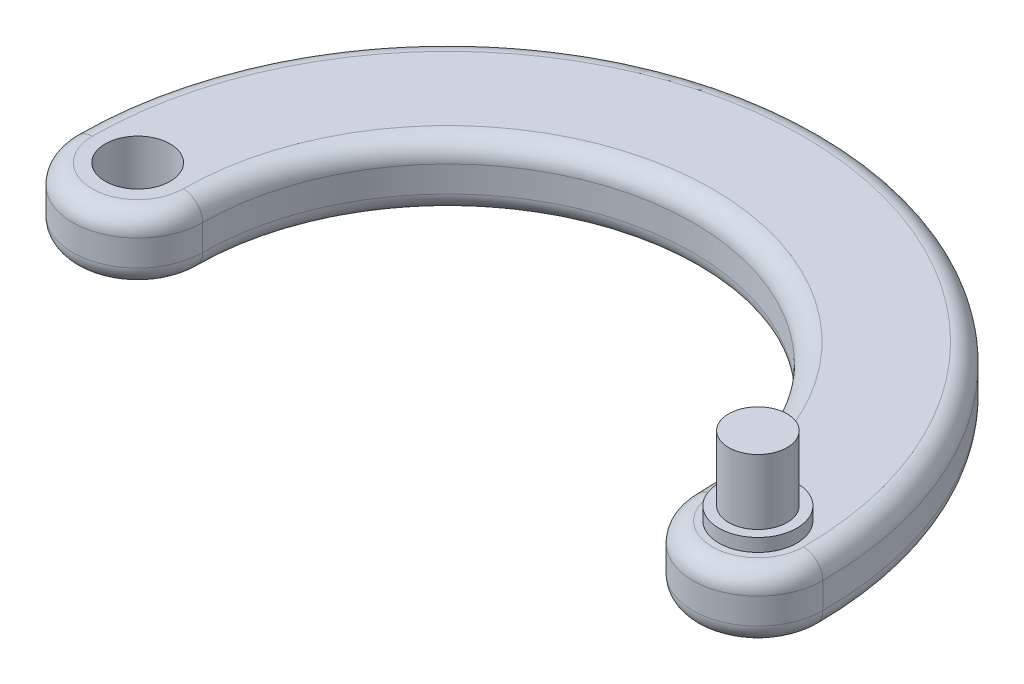
ISO-10303-21;
HEADER;
FILE_DESCRIPTION(('STEP AP214'),'2;1');
FILE_NAME('part.step','',(''),(''),'','','');
FILE_SCHEMA(('AUTOMOTIVE_DESIGN { 1 0 10303 214 1 1 1 1 }'));
ENDSEC;
DATA;
#1=APPLICATION_CONTEXT('core data for automotive mechanical design processes');
#2=APPLICATION_PROTOCOL_DEFINITION('international standard','automotive_design',2000,#1);
#3=PRODUCT_CONTEXT('',#1,'mechanical');
#4=PRODUCT('Part','Part','',(#3));
#5=PRODUCT_RELATED_PRODUCT_CATEGORY('part','',(#4));
#6=PRODUCT_DEFINITION_FORMATION('','',#4);
#7=PRODUCT_DEFINITION_CONTEXT('part definition',#1,'design');
#8=PRODUCT_DEFINITION('design','',#6,#7);
#9=PRODUCT_DEFINITION_SHAPE('','',#8);
#10=(LENGTH_UNIT() NAMED_UNIT(*) SI_UNIT(.MILLI.,.METRE.));
#11=(NAMED_UNIT(*) PLANE_ANGLE_UNIT() SI_UNIT($,.RADIAN.));
#12=(NAMED_UNIT(*) SI_UNIT($,.STERADIAN.) SOLID_ANGLE_UNIT());
#13=UNCERTAINTY_MEASURE_WITH_UNIT(LENGTH_MEASURE(1.E-05),#10,'distance_accuracy_value','');
#14=(GEOMETRIC_REPRESENTATION_CONTEXT(3) GLOBAL_UNCERTAINTY_ASSIGNED_CONTEXT((#13)) GLOBAL_UNIT_ASSIGNED_CONTEXT((#10,
#11,#12)) REPRESENTATION_CONTEXT('',''));
#15=CARTESIAN_POINT('',(0.,0.,0.));
#16=DIRECTION('',(0.,0.,1.));
#17=DIRECTION('',(1.,0.,0.));
#18=AXIS2_PLACEMENT_3D('',#15,#16,#17);
#19=CARTESIAN_POINT('',(-71.625,10.,0.));
#20=DIRECTION('',(0.,1.,0.));
#21=DIRECTION('',(0.,0.,1.));
#22=AXIS2_PLACEMENT_3D('',#19,#20,#21);
#23=PLANE('',#22);
#24=CARTESIAN_POINT('',(-47.75,10.,0.));
#25=DIRECTION('',(0.,1.,0.));
#26=DIRECTION('',(0.,0.,1.));
#27=AXIS2_PLACEMENT_3D('',#24,#25,#26);
#28=CIRCLE('',#27,40.75);
#29=CARTESIAN_POINT('',(-88.5,10.,0.));
#30=VERTEX_POINT('',#29);
#31=CARTESIAN_POINT('',(-7.00000000000001,10.,0.));
#32=VERTEX_POINT('',#31);
#33=EDGE_CURVE('E50',#30,#32,#28,.F.);
#34=ORIENTED_EDGE('',*,*,#33,.T.);
#35=CARTESIAN_POINT('',(0.,10.,0.));
#36=DIRECTION('',(0.,1.,0.));
#37=DIRECTION('',(0.,0.,1.));
#38=AXIS2_PLACEMENT_3D('',#35,#36,#37);
#39=CIRCLE('',#38,7.);
#40=CARTESIAN_POINT('',(7.00000000000001,10.,0.));
#41=VERTEX_POINT('',#40);
#42=EDGE_CURVE('E109',#32,#41,#39,.T.);
#43=ORIENTED_EDGE('',*,*,#42,.T.);
#44=CARTESIAN_POINT('',(-47.75,10.,0.));
#45=DIRECTION('',(0.,1.,0.));
#46=DIRECTION('',(0.,0.,1.));
#47=AXIS2_PLACEMENT_3D('',#44,#45,#46);
#48=CIRCLE('',#47,54.75);
#49=CARTESIAN_POINT('',(-102.5,10.,0.));
#50=VERTEX_POINT('',#49);
#51=EDGE_CURVE('E134',#41,#50,#48,.T.);
#52=ORIENTED_EDGE('',*,*,#51,.T.);
#53=CARTESIAN_POINT('',(-95.5,10.,0.));
#54=DIRECTION('',(0.,1.,0.));
#55=DIRECTION('',(0.,0.,1.));
#56=AXIS2_PLACEMENT_3D('',#53,#54,#55);
#57=CIRCLE('',#56,7.00000000000001);
#58=EDGE_CURVE('E55',#50,#30,#57,.T.);
#59=ORIENTED_EDGE('',*,*,#58,.T.);
#60=EDGE_LOOP('',(#34,#43,#52,#59));
#61=FACE_BOUND('',#60,.T.);
#62=CARTESIAN_POINT('',(0.,10.,0.));
#63=DIRECTION('',(0.,1.,0.));
#64=DIRECTION('',(0.,0.,1.));
#65=AXIS2_PLACEMENT_3D('',#62,#63,#64);
#66=CIRCLE('',#65,6.);
#67=CARTESIAN_POINT('',(0.,10.,6.));
#68=VERTEX_POINT('',#67);
#69=EDGE_CURVE('E157',#68,#68,#66,.T.);
#70=ORIENTED_EDGE('',*,*,#69,.F.);
#71=EDGE_LOOP('',(#70));
#72=FACE_BOUND('',#71,.T.);
#73=CARTESIAN_POINT('',(-95.5,10.,0.));
#74=DIRECTION('',(0.,1.,0.));
#75=DIRECTION('',(0.,0.,1.));
#76=AXIS2_PLACEMENT_3D('',#73,#74,#75);
#77=CIRCLE('',#76,5.);
#78=CARTESIAN_POINT('',(-95.5,10.,5.00000000000002));
#79=VERTEX_POINT('',#78);
#80=EDGE_CURVE('E122',#79,#79,#77,.T.);
#81=ORIENTED_EDGE('',*,*,#80,.F.);
#82=EDGE_LOOP('',(#81));
#83=FACE_BOUND('',#82,.T.);
#84=ADVANCED_FACE('F33',(#61,#72,#83),#23,.T.);
#85=CARTESIAN_POINT('',(-71.625,0.,0.));
#86=DIRECTION('',(0.,1.,0.));
#87=DIRECTION('',(0.,0.,1.));
#88=AXIS2_PLACEMENT_3D('',#85,#86,#87);
#89=PLANE('',#88);
#90=CARTESIAN_POINT('',(-47.75,0.,0.));
#91=DIRECTION('',(0.,1.,0.));
#92=DIRECTION('',(0.,0.,1.));
#93=AXIS2_PLACEMENT_3D('',#90,#91,#92);
#94=CIRCLE('',#93,54.75);
#95=CARTESIAN_POINT('',(-102.5,0.,0.));
#96=VERTEX_POINT('',#95);
#97=CARTESIAN_POINT('',(7.00000000000001,0.,0.));
#98=VERTEX_POINT('',#97);
#99=EDGE_CURVE('E186',#96,#98,#94,.F.);
#100=ORIENTED_EDGE('',*,*,#99,.T.);
#101=CARTESIAN_POINT('',(0.,0.,0.));
#102=DIRECTION('',(0.,1.,0.));
#103=DIRECTION('',(0.,0.,1.));
#104=AXIS2_PLACEMENT_3D('',#101,#102,#103);
#105=CIRCLE('',#104,7.);
#106=CARTESIAN_POINT('',(-7.00000000000001,0.,0.));
#107=VERTEX_POINT('',#106);
#108=EDGE_CURVE('E192',#98,#107,#105,.F.);
#109=ORIENTED_EDGE('',*,*,#108,.T.);
#110=CARTESIAN_POINT('',(-47.75,0.,0.));
#111=DIRECTION('',(0.,1.,0.));
#112=DIRECTION('',(0.,0.,1.));
#113=AXIS2_PLACEMENT_3D('',#110,#111,#112);
#114=CIRCLE('',#113,40.75);
#115=CARTESIAN_POINT('',(-88.5,0.,0.));
#116=VERTEX_POINT('',#115);
#117=EDGE_CURVE('E190',#107,#116,#114,.T.);
#118=ORIENTED_EDGE('',*,*,#117,.T.);
#119=CARTESIAN_POINT('',(-95.5,0.,0.));
#120=DIRECTION('',(0.,1.,0.));
#121=DIRECTION('',(0.,0.,1.));
#122=AXIS2_PLACEMENT_3D('',#119,#120,#121);
#123=CIRCLE('',#122,7.00000000000001);
#124=EDGE_CURVE('E188',#116,#96,#123,.F.);
#125=ORIENTED_EDGE('',*,*,#124,.T.);
#126=EDGE_LOOP('',(#100,#109,#118,#125));
#127=FACE_BOUND('',#126,.T.);
#128=CARTESIAN_POINT('',(-95.5,0.,0.));
#129=DIRECTION('',(0.,1.,0.));
#130=DIRECTION('',(0.,0.,1.));
#131=AXIS2_PLACEMENT_3D('',#128,#129,#130);
#132=CIRCLE('',#131,5.);
#133=CARTESIAN_POINT('',(-95.5,0.,5.00000000000002));
#134=VERTEX_POINT('',#133);
#135=EDGE_CURVE('E173',#134,#134,#132,.T.);
#136=ORIENTED_EDGE('',*,*,#135,.T.);
#137=EDGE_LOOP('',(#136));
#138=FACE_BOUND('',#137,.T.);
#139=ADVANCED_FACE('F232',(#127,#138),#89,.F.);
#140=CARTESIAN_POINT('',(-47.75,10.,0.));
#141=DIRECTION('',(0.,-1.,0.));
#142=DIRECTION('',(0.,0.,-1.));
#143=AXIS2_PLACEMENT_3D('',#140,#141,#142);
#144=CYLINDRICAL_SURFACE('',#143,57.75);
#145=DIRECTION('',(0.,-1.,0.));
#146=VECTOR('',#145,1.);
#147=CARTESIAN_POINT('',(10.,10.,0.));
#148=LINE('',#147,#146);
#149=CARTESIAN_POINT('',(10.,7.,0.));
#150=VERTEX_POINT('',#149);
#151=CARTESIAN_POINT('',(10.,3.,0.));
#152=VERTEX_POINT('',#151);
#153=EDGE_CURVE('E102',#150,#152,#148,.T.);
#154=ORIENTED_EDGE('',*,*,#153,.T.);
#155=CARTESIAN_POINT('',(-47.75,3.,0.));
#156=DIRECTION('',(0.,1.,0.));
#157=DIRECTION('',(0.,0.,1.));
#158=AXIS2_PLACEMENT_3D('',#155,#156,#157);
#159=CIRCLE('',#158,57.75);
#160=CARTESIAN_POINT('',(-105.5,3.,0.));
#161=VERTEX_POINT('',#160);
#162=EDGE_CURVE('E11',#152,#161,#159,.T.);
#163=ORIENTED_EDGE('',*,*,#162,.T.);
#164=DIRECTION('',(0.,-1.,0.));
#165=VECTOR('',#164,1.);
#166=CARTESIAN_POINT('',(-105.5,10.,0.));
#167=LINE('',#166,#165);
#168=CARTESIAN_POINT('',(-105.5,7.,0.));
#169=VERTEX_POINT('',#168);
#170=EDGE_CURVE('E104',#169,#161,#167,.T.);
#171=ORIENTED_EDGE('',*,*,#170,.F.);
#172=CARTESIAN_POINT('',(-47.75,7.,0.));
#173=DIRECTION('',(0.,1.,0.));
#174=DIRECTION('',(0.,0.,1.));
#175=AXIS2_PLACEMENT_3D('',#172,#173,#174);
#176=CIRCLE('',#175,57.75);
#177=EDGE_CURVE('E42',#169,#150,#176,.F.);
#178=ORIENTED_EDGE('',*,*,#177,.T.);
#179=EDGE_LOOP('',(#154,#163,#171,#178));
#180=FACE_BOUND('',#179,.T.);
#181=ADVANCED_FACE('F101',(#180),#144,.T.);
#182=CARTESIAN_POINT('',(-95.5,10.,0.));
#183=DIRECTION('',(0.,-1.,0.));
#184=DIRECTION('',(0.,0.,-1.));
#185=AXIS2_PLACEMENT_3D('',#182,#183,#184);
#186=CYLINDRICAL_SURFACE('',#185,10.);
#187=ORIENTED_EDGE('',*,*,#170,.T.);
#188=CARTESIAN_POINT('',(-95.5,3.,0.));
#189=DIRECTION('',(0.,1.,0.));
#190=DIRECTION('',(0.,0.,1.));
#191=AXIS2_PLACEMENT_3D('',#188,#189,#190);
#192=CIRCLE('',#191,10.);
#193=CARTESIAN_POINT('',(-85.5,3.,0.));
#194=VERTEX_POINT('',#193);
#195=EDGE_CURVE('E201',#161,#194,#192,.T.);
#196=ORIENTED_EDGE('',*,*,#195,.T.);
#197=DIRECTION('',(0.,-1.,0.));
#198=VECTOR('',#197,1.);
#199=CARTESIAN_POINT('',(-85.5,10.,0.));
#200=LINE('',#199,#198);
#201=CARTESIAN_POINT('',(-85.5,7.,0.));
#202=VERTEX_POINT('',#201);
#203=EDGE_CURVE('E179',#202,#194,#200,.T.);
#204=ORIENTED_EDGE('',*,*,#203,.F.);
#205=CARTESIAN_POINT('',(-95.5,7.,0.));
#206=DIRECTION('',(0.,1.,0.));
#207=DIRECTION('',(0.,0.,1.));
#208=AXIS2_PLACEMENT_3D('',#205,#206,#207);
#209=CIRCLE('',#208,10.);
#210=EDGE_CURVE('E199',#202,#169,#209,.F.);
#211=ORIENTED_EDGE('',*,*,#210,.T.);
#212=EDGE_LOOP('',(#187,#196,#204,#211));
#213=FACE_BOUND('',#212,.T.);
#214=ADVANCED_FACE('F214',(#213),#186,.T.);
#215=CARTESIAN_POINT('',(-47.75,10.,0.));
#216=DIRECTION('',(0.,-1.,0.));
#217=DIRECTION('',(0.,0.,-1.));
#218=AXIS2_PLACEMENT_3D('',#215,#216,#217);
#219=CYLINDRICAL_SURFACE('',#218,37.75);
#220=ORIENTED_EDGE('',*,*,#203,.T.);
#221=CARTESIAN_POINT('',(-47.75,3.,0.));
#222=DIRECTION('',(0.,1.,0.));
#223=DIRECTION('',(0.,0.,1.));
#224=AXIS2_PLACEMENT_3D('',#221,#222,#223);
#225=CIRCLE('',#224,37.75);
#226=CARTESIAN_POINT('',(-10.,3.,0.));
#227=VERTEX_POINT('',#226);
#228=EDGE_CURVE('E197',#194,#227,#225,.F.);
#229=ORIENTED_EDGE('',*,*,#228,.T.);
#230=DIRECTION('',(0.,-1.,0.));
#231=VECTOR('',#230,1.);
#232=CARTESIAN_POINT('',(-10.,10.,0.));
#233=LINE('',#232,#231);
#234=CARTESIAN_POINT('',(-10.,7.,0.));
#235=VERTEX_POINT('',#234);
#236=EDGE_CURVE('E121',#235,#227,#233,.T.);
#237=ORIENTED_EDGE('',*,*,#236,.F.);
#238=CARTESIAN_POINT('',(-47.75,7.,0.));
#239=DIRECTION('',(0.,1.,0.));
#240=DIRECTION('',(0.,0.,1.));
#241=AXIS2_PLACEMENT_3D('',#238,#239,#240);
#242=CIRCLE('',#241,37.75);
#243=EDGE_CURVE('E195',#235,#202,#242,.T.);
#244=ORIENTED_EDGE('',*,*,#243,.T.);
#245=EDGE_LOOP('',(#220,#229,#237,#244));
#246=FACE_BOUND('',#245,.T.);
#247=ADVANCED_FACE('F212',(#246),#219,.F.);
#248=CARTESIAN_POINT('',(0.,10.,0.));
#249=DIRECTION('',(0.,-1.,0.));
#250=DIRECTION('',(0.,0.,-1.));
#251=AXIS2_PLACEMENT_3D('',#248,#249,#250);
#252=CYLINDRICAL_SURFACE('',#251,10.);
#253=ORIENTED_EDGE('',*,*,#236,.T.);
#254=CARTESIAN_POINT('',(0.,3.,0.));
#255=DIRECTION('',(0.,1.,0.));
#256=DIRECTION('',(0.,0.,1.));
#257=AXIS2_PLACEMENT_3D('',#254,#255,#256);
#258=CIRCLE('',#257,10.);
#259=EDGE_CURVE('E120',#227,#152,#258,.T.);
#260=ORIENTED_EDGE('',*,*,#259,.T.);
#261=ORIENTED_EDGE('',*,*,#153,.F.);
#262=CARTESIAN_POINT('',(0.,7.,0.));
#263=DIRECTION('',(0.,1.,0.));
#264=DIRECTION('',(0.,0.,1.));
#265=AXIS2_PLACEMENT_3D('',#262,#263,#264);
#266=CIRCLE('',#265,10.);
#267=EDGE_CURVE('E117',#150,#235,#266,.F.);
#268=ORIENTED_EDGE('',*,*,#267,.T.);
#269=EDGE_LOOP('',(#253,#260,#261,#268));
#270=FACE_BOUND('',#269,.T.);
#271=ADVANCED_FACE('F116',(#270),#252,.T.);
#272=CARTESIAN_POINT('',(-95.5,10.,0.));
#273=DIRECTION('',(0.,-1.,0.));
#274=DIRECTION('',(0.,0.,-1.));
#275=AXIS2_PLACEMENT_3D('',#272,#273,#274);
#276=CYLINDRICAL_SURFACE('',#275,5.);
#277=ORIENTED_EDGE('',*,*,#80,.T.);
#278=EDGE_LOOP('',(#277));
#279=FACE_BOUND('',#278,.T.);
#280=ORIENTED_EDGE('',*,*,#135,.F.);
#281=EDGE_LOOP('',(#280));
#282=FACE_BOUND('',#281,.T.);
#283=ADVANCED_FACE('F240',(#279,#282),#276,.F.);
#284=CARTESIAN_POINT('',(0.,12.,0.));
#285=DIRECTION('',(0.,-1.,0.));
#286=DIRECTION('',(0.,0.,-1.));
#287=AXIS2_PLACEMENT_3D('',#284,#285,#286);
#288=CYLINDRICAL_SURFACE('',#287,6.);
#289=CARTESIAN_POINT('',(0.,12.,0.));
#290=DIRECTION('',(0.,1.,0.));
#291=DIRECTION('',(0.,0.,1.));
#292=AXIS2_PLACEMENT_3D('',#289,#290,#291);
#293=CIRCLE('',#292,6.);
#294=CARTESIAN_POINT('',(0.,12.,6.));
#295=VERTEX_POINT('',#294);
#296=EDGE_CURVE('E163',#295,#295,#293,.T.);
#297=ORIENTED_EDGE('',*,*,#296,.F.);
#298=EDGE_LOOP('',(#297));
#299=FACE_BOUND('',#298,.T.);
#300=ORIENTED_EDGE('',*,*,#69,.T.);
#301=EDGE_LOOP('',(#300));
#302=FACE_BOUND('',#301,.T.);
#303=ADVANCED_FACE('F272',(#299,#302),#288,.T.);
#304=CARTESIAN_POINT('',(0.,12.,0.));
#305=DIRECTION('',(0.,1.,0.));
#306=DIRECTION('',(0.,0.,1.));
#307=AXIS2_PLACEMENT_3D('',#304,#305,#306);
#308=PLANE('',#307);
#309=CARTESIAN_POINT('',(0.,12.,0.));
#310=DIRECTION('',(0.,1.,0.));
#311=DIRECTION('',(0.,0.,1.));
#312=AXIS2_PLACEMENT_3D('',#309,#310,#311);
#313=CIRCLE('',#312,4.5);
#314=CARTESIAN_POINT('',(0.,12.,4.5));
#315=VERTEX_POINT('',#314);
#316=EDGE_CURVE('E131',#315,#315,#313,.F.);
#317=ORIENTED_EDGE('',*,*,#316,.T.);
#318=EDGE_LOOP('',(#317));
#319=FACE_BOUND('',#318,.T.);
#320=ORIENTED_EDGE('',*,*,#296,.T.);
#321=EDGE_LOOP('',(#320));
#322=FACE_BOUND('',#321,.T.);
#323=ADVANCED_FACE('F280',(#319,#322),#308,.T.);
#324=CARTESIAN_POINT('',(0.,22.,0.));
#325=DIRECTION('',(0.,1.,0.));
#326=DIRECTION('',(0.,0.,1.));
#327=AXIS2_PLACEMENT_3D('',#324,#325,#326);
#328=PLANE('',#327);
#329=CARTESIAN_POINT('',(0.,22.,0.));
#330=DIRECTION('',(0.,1.,0.));
#331=DIRECTION('',(0.,0.,1.));
#332=AXIS2_PLACEMENT_3D('',#329,#330,#331);
#333=CIRCLE('',#332,4.5);
#334=CARTESIAN_POINT('',(0.,22.,4.5));
#335=VERTEX_POINT('',#334);
#336=EDGE_CURVE('E168',#335,#335,#333,.T.);
#337=ORIENTED_EDGE('',*,*,#336,.T.);
#338=EDGE_LOOP('',(#337));
#339=FACE_BOUND('',#338,.T.);
#340=ADVANCED_FACE('F288',(#339),#328,.T.);
#341=CARTESIAN_POINT('',(0.,0.,0.));
#342=DIRECTION('',(0.,1.,0.));
#343=DIRECTION('',(0.,0.,1.));
#344=AXIS2_PLACEMENT_3D('',#341,#342,#343);
#345=CYLINDRICAL_SURFACE('',#344,4.5);
#346=ORIENTED_EDGE('',*,*,#316,.F.);
#347=EDGE_LOOP('',(#346));
#348=FACE_BOUND('',#347,.T.);
#349=ORIENTED_EDGE('',*,*,#336,.F.);
#350=EDGE_LOOP('',(#349));
#351=FACE_BOUND('',#350,.T.);
#352=ADVANCED_FACE('F296',(#348,#351),#345,.T.);
#353=CARTESIAN_POINT('',(-95.5,3.,0.));
#354=DIRECTION('',(0.,1.,0.));
#355=DIRECTION('',(0.,0.,1.));
#356=AXIS2_PLACEMENT_3D('',#353,#354,#355);
#357=TOROIDAL_SURFACE('',#356,7.00000000000001,3.);
#358=CARTESIAN_POINT('',(-102.5,3.,0.));
#359=DIRECTION('',(0.,0.,-1.));
#360=DIRECTION('',(-1.,0.,0.));
#361=AXIS2_PLACEMENT_3D('',#358,#359,#360);
#362=CIRCLE('',#361,3.);
#363=EDGE_CURVE('E150',#96,#161,#362,.T.);
#364=ORIENTED_EDGE('',*,*,#363,.F.);
#365=ORIENTED_EDGE('',*,*,#124,.F.);
#366=CARTESIAN_POINT('',(-88.5,3.,0.));
#367=DIRECTION('',(0.,0.,-1.));
#368=DIRECTION('',(0.,1.,0.));
#369=AXIS2_PLACEMENT_3D('',#366,#367,#368);
#370=CIRCLE('',#369,3.);
#371=EDGE_CURVE('E139',#194,#116,#370,.T.);
#372=ORIENTED_EDGE('',*,*,#371,.F.);
#373=ORIENTED_EDGE('',*,*,#195,.F.);
#374=EDGE_LOOP('',(#364,#365,#372,#373));
#375=FACE_BOUND('',#374,.T.);
#376=ADVANCED_FACE('F217',(#375),#357,.T.);
#377=CARTESIAN_POINT('',(-47.75,3.,0.));
#378=DIRECTION('',(0.,1.,0.));
#379=DIRECTION('',(0.,0.,1.));
#380=AXIS2_PLACEMENT_3D('',#377,#378,#379);
#381=TOROIDAL_SURFACE('',#380,40.75,3.);
#382=ORIENTED_EDGE('',*,*,#371,.T.);
#383=ORIENTED_EDGE('',*,*,#117,.F.);
#384=CARTESIAN_POINT('',(-7.00000000000001,3.,0.));
#385=DIRECTION('',(0.,0.,1.));
#386=DIRECTION('',(0.,-1.,0.));
#387=AXIS2_PLACEMENT_3D('',#384,#385,#386);
#388=CIRCLE('',#387,3.);
#389=EDGE_CURVE('E144',#227,#107,#388,.T.);
#390=ORIENTED_EDGE('',*,*,#389,.F.);
#391=ORIENTED_EDGE('',*,*,#228,.F.);
#392=EDGE_LOOP('',(#382,#383,#390,#391));
#393=FACE_BOUND('',#392,.T.);
#394=ADVANCED_FACE('F220',(#393),#381,.T.);
#395=CARTESIAN_POINT('',(-47.75,3.,0.));
#396=DIRECTION('',(0.,1.,0.));
#397=DIRECTION('',(0.,0.,1.));
#398=AXIS2_PLACEMENT_3D('',#395,#396,#397);
#399=TOROIDAL_SURFACE('',#398,54.75,3.);
#400=ORIENTED_EDGE('',*,*,#363,.T.);
#401=ORIENTED_EDGE('',*,*,#162,.F.);
#402=CARTESIAN_POINT('',(7.00000000000001,3.,0.));
#403=DIRECTION('',(0.,0.,1.));
#404=DIRECTION('',(1.,0.,0.));
#405=AXIS2_PLACEMENT_3D('',#402,#403,#404);
#406=CIRCLE('',#405,3.);
#407=EDGE_CURVE('E142',#98,#152,#406,.T.);
#408=ORIENTED_EDGE('',*,*,#407,.F.);
#409=ORIENTED_EDGE('',*,*,#99,.F.);
#410=EDGE_LOOP('',(#400,#401,#408,#409));
#411=FACE_BOUND('',#410,.T.);
#412=ADVANCED_FACE('F223',(#411),#399,.T.);
#413=CARTESIAN_POINT('',(0.,3.,0.));
#414=DIRECTION('',(0.,1.,0.));
#415=DIRECTION('',(0.,0.,1.));
#416=AXIS2_PLACEMENT_3D('',#413,#414,#415);
#417=TOROIDAL_SURFACE('',#416,7.,3.);
#418=ORIENTED_EDGE('',*,*,#389,.T.);
#419=ORIENTED_EDGE('',*,*,#108,.F.);
#420=ORIENTED_EDGE('',*,*,#407,.T.);
#421=ORIENTED_EDGE('',*,*,#259,.F.);
#422=EDGE_LOOP('',(#418,#419,#420,#421));
#423=FACE_BOUND('',#422,.T.);
#424=ADVANCED_FACE('F221',(#423),#417,.T.);
#425=CARTESIAN_POINT('',(-95.5,7.,0.));
#426=DIRECTION('',(0.,1.,0.));
#427=DIRECTION('',(0.,0.,1.));
#428=AXIS2_PLACEMENT_3D('',#425,#426,#427);
#429=TOROIDAL_SURFACE('',#428,7.00000000000001,3.);
#430=CARTESIAN_POINT('',(-102.5,7.,0.));
#431=DIRECTION('',(0.,0.,-1.));
#432=DIRECTION('',(-1.,0.,0.));
#433=AXIS2_PLACEMENT_3D('',#430,#431,#432);
#434=CIRCLE('',#433,3.);
#435=EDGE_CURVE('E136',#169,#50,#434,.T.);
#436=ORIENTED_EDGE('',*,*,#435,.F.);
#437=ORIENTED_EDGE('',*,*,#210,.F.);
#438=CARTESIAN_POINT('',(-88.5,7.,0.));
#439=DIRECTION('',(0.,0.,-1.));
#440=DIRECTION('',(-1.,0.,0.));
#441=AXIS2_PLACEMENT_3D('',#438,#439,#440);
#442=CIRCLE('',#441,3.);
#443=EDGE_CURVE('E37',#30,#202,#442,.T.);
#444=ORIENTED_EDGE('',*,*,#443,.F.);
#445=ORIENTED_EDGE('',*,*,#58,.F.);
#446=EDGE_LOOP('',(#436,#437,#444,#445));
#447=FACE_BOUND('',#446,.T.);
#448=ADVANCED_FACE('F35',(#447),#429,.T.);
#449=CARTESIAN_POINT('',(-47.75,7.,0.));
#450=DIRECTION('',(0.,1.,0.));
#451=DIRECTION('',(0.,0.,1.));
#452=AXIS2_PLACEMENT_3D('',#449,#450,#451);
#453=TOROIDAL_SURFACE('',#452,40.75,3.);
#454=ORIENTED_EDGE('',*,*,#443,.T.);
#455=ORIENTED_EDGE('',*,*,#243,.F.);
#456=CARTESIAN_POINT('',(-7.00000000000001,7.,0.));
#457=DIRECTION('',(0.,0.,1.));
#458=DIRECTION('',(1.,0.,0.));
#459=AXIS2_PLACEMENT_3D('',#456,#457,#458);
#460=CIRCLE('',#459,3.);
#461=EDGE_CURVE('E129',#32,#235,#460,.T.);
#462=ORIENTED_EDGE('',*,*,#461,.F.);
#463=ORIENTED_EDGE('',*,*,#33,.F.);
#464=EDGE_LOOP('',(#454,#455,#462,#463));
#465=FACE_BOUND('',#464,.T.);
#466=ADVANCED_FACE('F209',(#465),#453,.T.);
#467=CARTESIAN_POINT('',(-47.75,7.,0.));
#468=DIRECTION('',(0.,1.,0.));
#469=DIRECTION('',(0.,0.,1.));
#470=AXIS2_PLACEMENT_3D('',#467,#468,#469);
#471=TOROIDAL_SURFACE('',#470,54.75,3.);
#472=ORIENTED_EDGE('',*,*,#435,.T.);
#473=ORIENTED_EDGE('',*,*,#51,.F.);
#474=CARTESIAN_POINT('',(7.00000000000001,7.,0.));
#475=DIRECTION('',(0.,0.,1.));
#476=DIRECTION('',(0.,-1.,0.));
#477=AXIS2_PLACEMENT_3D('',#474,#475,#476);
#478=CIRCLE('',#477,3.);
#479=EDGE_CURVE('E127',#150,#41,#478,.T.);
#480=ORIENTED_EDGE('',*,*,#479,.F.);
#481=ORIENTED_EDGE('',*,*,#177,.F.);
#482=EDGE_LOOP('',(#472,#473,#480,#481));
#483=FACE_BOUND('',#482,.T.);
#484=ADVANCED_FACE('F133',(#483),#471,.T.);
#485=CARTESIAN_POINT('',(0.,7.,0.));
#486=DIRECTION('',(0.,1.,0.));
#487=DIRECTION('',(0.,0.,1.));
#488=AXIS2_PLACEMENT_3D('',#485,#486,#487);
#489=TOROIDAL_SURFACE('',#488,7.,3.);
#490=ORIENTED_EDGE('',*,*,#461,.T.);
#491=ORIENTED_EDGE('',*,*,#267,.F.);
#492=ORIENTED_EDGE('',*,*,#479,.T.);
#493=ORIENTED_EDGE('',*,*,#42,.F.);
#494=EDGE_LOOP('',(#490,#491,#492,#493));
#495=FACE_BOUND('',#494,.T.);
#496=ADVANCED_FACE('F125',(#495),#489,.T.);
#497=CLOSED_SHELL('',(#84,#139,#181,#214,#247,#271,#283,#303,#323,#340,#352,#376,#394,#412,#424,
#448,#466,#484,#496));
#498=MANIFOLD_SOLID_BREP('B2',#497);
#499=ADVANCED_BREP_SHAPE_REPRESENTATION('',(#18,#498),#14);
#500=SHAPE_DEFINITION_REPRESENTATION(#9,#499);
ENDSEC;
END-ISO-10303-21;
